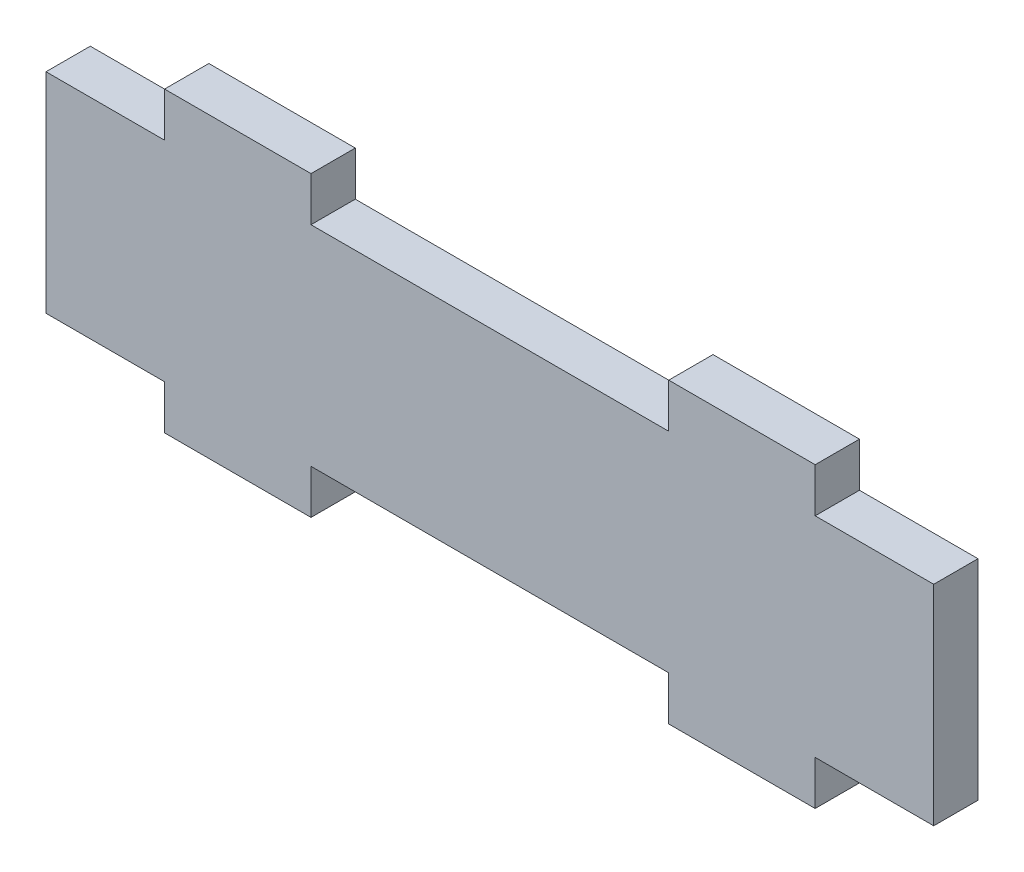
ISO-10303-21;
HEADER;
FILE_DESCRIPTION(('STEP AP214'),'2;1');
FILE_NAME('part.step','',(''),(''),'','','');
FILE_SCHEMA(('AUTOMOTIVE_DESIGN { 1 0 10303 214 1 1 1 1 }'));
ENDSEC;
DATA;
#1=APPLICATION_CONTEXT('core data for automotive mechanical design processes');
#2=APPLICATION_PROTOCOL_DEFINITION('international standard','automotive_design',2000,#1);
#3=PRODUCT_CONTEXT('',#1,'mechanical');
#4=PRODUCT('Part','Part','',(#3));
#5=PRODUCT_RELATED_PRODUCT_CATEGORY('part','',(#4));
#6=PRODUCT_DEFINITION_FORMATION('','',#4);
#7=PRODUCT_DEFINITION_CONTEXT('part definition',#1,'design');
#8=PRODUCT_DEFINITION('design','',#6,#7);
#9=PRODUCT_DEFINITION_SHAPE('','',#8);
#10=(LENGTH_UNIT() NAMED_UNIT(*) SI_UNIT(.MILLI.,.METRE.));
#11=(NAMED_UNIT(*) PLANE_ANGLE_UNIT() SI_UNIT($,.RADIAN.));
#12=(NAMED_UNIT(*) SI_UNIT($,.STERADIAN.) SOLID_ANGLE_UNIT());
#13=UNCERTAINTY_MEASURE_WITH_UNIT(LENGTH_MEASURE(1.E-05),#10,'distance_accuracy_value','');
#14=(GEOMETRIC_REPRESENTATION_CONTEXT(3) GLOBAL_UNCERTAINTY_ASSIGNED_CONTEXT((#13)) GLOBAL_UNIT_ASSIGNED_CONTEXT((#10,
#11,#12)) REPRESENTATION_CONTEXT('',''));
#15=CARTESIAN_POINT('',(0.,0.,0.));
#16=DIRECTION('',(0.,0.,1.));
#17=DIRECTION('',(1.,0.,0.));
#18=AXIS2_PLACEMENT_3D('',#15,#16,#17);
#19=CARTESIAN_POINT('',(0.,0.,0.));
#20=DIRECTION('',(0.,0.,1.));
#21=DIRECTION('',(1.,0.,0.));
#22=AXIS2_PLACEMENT_3D('',#19,#20,#21);
#23=PLANE('',#22);
#24=DIRECTION('',(0.,1.,0.));
#25=VECTOR('',#24,1.);
#26=CARTESIAN_POINT('',(23.325,0.,0.));
#27=LINE('',#26,#25);
#28=CARTESIAN_POINT('',(23.325,7.5,0.));
#29=VERTEX_POINT('',#28);
#30=CARTESIAN_POINT('',(23.325,10.675,0.));
#31=VERTEX_POINT('',#30);
#32=EDGE_CURVE('E343',#29,#31,#27,.T.);
#33=ORIENTED_EDGE('',*,*,#32,.F.);
#34=DIRECTION('',(1.,0.,0.));
#35=VECTOR('',#34,1.);
#36=CARTESIAN_POINT('',(0.,7.5,0.));
#37=LINE('',#36,#35);
#38=CARTESIAN_POINT('',(31.825,7.5,0.));
#39=VERTEX_POINT('',#38);
#40=EDGE_CURVE('E400',#29,#39,#37,.T.);
#41=ORIENTED_EDGE('',*,*,#40,.T.);
#42=DIRECTION('',(0.,1.,0.));
#43=VECTOR('',#42,1.);
#44=CARTESIAN_POINT('',(31.825,0.,0.));
#45=LINE('',#44,#43);
#46=CARTESIAN_POINT('',(31.825,-7.5,0.));
#47=VERTEX_POINT('',#46);
#48=EDGE_CURVE('E397',#47,#39,#45,.T.);
#49=ORIENTED_EDGE('',*,*,#48,.F.);
#50=DIRECTION('',(1.,0.,0.));
#51=VECTOR('',#50,1.);
#52=CARTESIAN_POINT('',(0.,-7.5,0.));
#53=LINE('',#52,#51);
#54=CARTESIAN_POINT('',(23.325,-7.5,0.));
#55=VERTEX_POINT('',#54);
#56=EDGE_CURVE('E379',#55,#47,#53,.T.);
#57=ORIENTED_EDGE('',*,*,#56,.F.);
#58=DIRECTION('',(0.,-1.,0.));
#59=VECTOR('',#58,1.);
#60=CARTESIAN_POINT('',(23.325,0.,0.));
#61=LINE('',#60,#59);
#62=CARTESIAN_POINT('',(23.325,-10.675,0.));
#63=VERTEX_POINT('',#62);
#64=EDGE_CURVE('E394',#55,#63,#61,.T.);
#65=ORIENTED_EDGE('',*,*,#64,.T.);
#66=DIRECTION('',(-1.,0.,0.));
#67=VECTOR('',#66,1.);
#68=CARTESIAN_POINT('',(0.,-10.675,0.));
#69=LINE('',#68,#67);
#70=CARTESIAN_POINT('',(12.825,-10.675,0.));
#71=VERTEX_POINT('',#70);
#72=EDGE_CURVE('E391',#63,#71,#69,.T.);
#73=ORIENTED_EDGE('',*,*,#72,.T.);
#74=DIRECTION('',(0.,-1.,0.));
#75=VECTOR('',#74,1.);
#76=CARTESIAN_POINT('',(12.825,0.,0.));
#77=LINE('',#76,#75);
#78=CARTESIAN_POINT('',(12.825,-7.5,0.));
#79=VERTEX_POINT('',#78);
#80=EDGE_CURVE('E388',#79,#71,#77,.T.);
#81=ORIENTED_EDGE('',*,*,#80,.F.);
#82=CARTESIAN_POINT('',(-12.825,-7.5,0.));
#83=VERTEX_POINT('',#82);
#84=EDGE_CURVE('E380',#83,#79,#53,.T.);
#85=ORIENTED_EDGE('',*,*,#84,.F.);
#86=DIRECTION('',(0.,-1.,0.));
#87=VECTOR('',#86,1.);
#88=CARTESIAN_POINT('',(-12.825,0.,0.));
#89=LINE('',#88,#87);
#90=CARTESIAN_POINT('',(-12.825,-10.675,0.));
#91=VERTEX_POINT('',#90);
#92=EDGE_CURVE('E385',#83,#91,#89,.T.);
#93=ORIENTED_EDGE('',*,*,#92,.T.);
#94=DIRECTION('',(1.,0.,0.));
#95=VECTOR('',#94,1.);
#96=CARTESIAN_POINT('',(0.,-10.675,0.));
#97=LINE('',#96,#95);
#98=CARTESIAN_POINT('',(-23.325,-10.675,0.));
#99=VERTEX_POINT('',#98);
#100=EDGE_CURVE('E382',#99,#91,#97,.T.);
#101=ORIENTED_EDGE('',*,*,#100,.F.);
#102=DIRECTION('',(0.,-1.,0.));
#103=VECTOR('',#102,1.);
#104=CARTESIAN_POINT('',(-23.325,0.,0.));
#105=LINE('',#104,#103);
#106=CARTESIAN_POINT('',(-23.325,-7.5,0.));
#107=VERTEX_POINT('',#106);
#108=EDGE_CURVE('E378',#107,#99,#105,.T.);
#109=ORIENTED_EDGE('',*,*,#108,.F.);
#110=CARTESIAN_POINT('',(-31.825,-7.5,0.));
#111=VERTEX_POINT('',#110);
#112=EDGE_CURVE('E332',#111,#107,#53,.T.);
#113=ORIENTED_EDGE('',*,*,#112,.F.);
#114=DIRECTION('',(0.,1.,0.));
#115=VECTOR('',#114,1.);
#116=CARTESIAN_POINT('',(-31.825,0.,0.));
#117=LINE('',#116,#115);
#118=CARTESIAN_POINT('',(-31.825,7.5,0.));
#119=VERTEX_POINT('',#118);
#120=EDGE_CURVE('E405',#111,#119,#117,.T.);
#121=ORIENTED_EDGE('',*,*,#120,.T.);
#122=CARTESIAN_POINT('',(-23.325,7.5,0.));
#123=VERTEX_POINT('',#122);
#124=EDGE_CURVE('E404',#119,#123,#37,.T.);
#125=ORIENTED_EDGE('',*,*,#124,.T.);
#126=DIRECTION('',(0.,1.,0.));
#127=VECTOR('',#126,1.);
#128=CARTESIAN_POINT('',(-23.325,4.325,0.));
#129=LINE('',#128,#127);
#130=CARTESIAN_POINT('',(-23.325,10.675,0.));
#131=VERTEX_POINT('',#130);
#132=EDGE_CURVE('E308',#123,#131,#129,.T.);
#133=ORIENTED_EDGE('',*,*,#132,.T.);
#134=DIRECTION('',(1.,0.,0.));
#135=VECTOR('',#134,1.);
#136=CARTESIAN_POINT('',(-23.325,10.675,0.));
#137=LINE('',#136,#135);
#138=CARTESIAN_POINT('',(-12.825,10.675,0.));
#139=VERTEX_POINT('',#138);
#140=EDGE_CURVE('E324',#131,#139,#137,.T.);
#141=ORIENTED_EDGE('',*,*,#140,.T.);
#142=DIRECTION('',(0.,1.,0.));
#143=VECTOR('',#142,1.);
#144=CARTESIAN_POINT('',(-12.825,4.325,0.));
#145=LINE('',#144,#143);
#146=CARTESIAN_POINT('',(-12.825,7.5,0.));
#147=VERTEX_POINT('',#146);
#148=EDGE_CURVE('E314',#147,#139,#145,.T.);
#149=ORIENTED_EDGE('',*,*,#148,.F.);
#150=CARTESIAN_POINT('',(12.825,7.5,0.));
#151=VERTEX_POINT('',#150);
#152=EDGE_CURVE('E403',#147,#151,#37,.T.);
#153=ORIENTED_EDGE('',*,*,#152,.T.);
#154=DIRECTION('',(0.,1.,0.));
#155=VECTOR('',#154,1.);
#156=CARTESIAN_POINT('',(12.825,0.,0.));
#157=LINE('',#156,#155);
#158=CARTESIAN_POINT('',(12.825,10.675,0.));
#159=VERTEX_POINT('',#158);
#160=EDGE_CURVE('E469',#151,#159,#157,.T.);
#161=ORIENTED_EDGE('',*,*,#160,.T.);
#162=DIRECTION('',(-1.,0.,0.));
#163=VECTOR('',#162,1.);
#164=CARTESIAN_POINT('',(0.,10.675,0.));
#165=LINE('',#164,#163);
#166=EDGE_CURVE('E473',#31,#159,#165,.T.);
#167=ORIENTED_EDGE('',*,*,#166,.F.);
#168=EDGE_LOOP('',(#33,#41,#49,#57,#65,#73,#81,#85,#93,#101,#109,#113,#121,#125,#133,#141,#149,
#153,#161,#167));
#169=FACE_BOUND('',#168,.T.);
#170=ADVANCED_FACE('F176',(#169),#23,.F.);
#171=CARTESIAN_POINT('',(23.325,0.,3.175));
#172=DIRECTION('',(-1.,0.,0.));
#173=DIRECTION('',(0.,-1.,0.));
#174=AXIS2_PLACEMENT_3D('',#171,#172,#173);
#175=PLANE('',#174);
#176=ORIENTED_EDGE('',*,*,#32,.T.);
#177=DIRECTION('',(0.,0.,-1.));
#178=VECTOR('',#177,1.);
#179=CARTESIAN_POINT('',(23.325,10.675,3.175));
#180=LINE('',#179,#178);
#181=CARTESIAN_POINT('',(23.325,10.675,3.175));
#182=VERTEX_POINT('',#181);
#183=EDGE_CURVE('E186',#182,#31,#180,.T.);
#184=ORIENTED_EDGE('',*,*,#183,.F.);
#185=DIRECTION('',(0.,1.,0.));
#186=VECTOR('',#185,1.);
#187=CARTESIAN_POINT('',(23.325,0.,3.175));
#188=LINE('',#187,#186);
#189=CARTESIAN_POINT('',(23.325,7.5,3.175));
#190=VERTEX_POINT('',#189);
#191=EDGE_CURVE('E461',#190,#182,#188,.T.);
#192=ORIENTED_EDGE('',*,*,#191,.F.);
#193=DIRECTION('',(0.,0.,-1.));
#194=VECTOR('',#193,1.);
#195=CARTESIAN_POINT('',(23.325,7.5,3.175));
#196=LINE('',#195,#194);
#197=EDGE_CURVE('E12',#190,#29,#196,.T.);
#198=ORIENTED_EDGE('',*,*,#197,.T.);
#199=EDGE_LOOP('',(#176,#184,#192,#198));
#200=FACE_BOUND('',#199,.T.);
#201=ADVANCED_FACE('F465',(#200),#175,.F.);
#202=CARTESIAN_POINT('',(0.,10.675,3.175));
#203=DIRECTION('',(0.,-1.,0.));
#204=DIRECTION('',(1.,0.,0.));
#205=AXIS2_PLACEMENT_3D('',#202,#203,#204);
#206=PLANE('',#205);
#207=ORIENTED_EDGE('',*,*,#166,.T.);
#208=DIRECTION('',(0.,0.,-1.));
#209=VECTOR('',#208,1.);
#210=CARTESIAN_POINT('',(12.825,10.675,3.175));
#211=LINE('',#210,#209);
#212=CARTESIAN_POINT('',(12.825,10.675,3.175));
#213=VERTEX_POINT('',#212);
#214=EDGE_CURVE('E481',#213,#159,#211,.T.);
#215=ORIENTED_EDGE('',*,*,#214,.F.);
#216=DIRECTION('',(-1.,0.,0.));
#217=VECTOR('',#216,1.);
#218=CARTESIAN_POINT('',(0.,10.675,3.175));
#219=LINE('',#218,#217);
#220=EDGE_CURVE('E468',#182,#213,#219,.T.);
#221=ORIENTED_EDGE('',*,*,#220,.F.);
#222=ORIENTED_EDGE('',*,*,#183,.T.);
#223=EDGE_LOOP('',(#207,#215,#221,#222));
#224=FACE_BOUND('',#223,.T.);
#225=ADVANCED_FACE('F522',(#224),#206,.F.);
#226=CARTESIAN_POINT('',(12.825,0.,3.175));
#227=DIRECTION('',(-1.,0.,0.));
#228=DIRECTION('',(0.,-1.,0.));
#229=AXIS2_PLACEMENT_3D('',#226,#227,#228);
#230=PLANE('',#229);
#231=ORIENTED_EDGE('',*,*,#160,.F.);
#232=DIRECTION('',(0.,0.,-1.));
#233=VECTOR('',#232,1.);
#234=CARTESIAN_POINT('',(12.825,7.5,3.175));
#235=LINE('',#234,#233);
#236=CARTESIAN_POINT('',(12.825,7.5,3.175));
#237=VERTEX_POINT('',#236);
#238=EDGE_CURVE('E195',#237,#151,#235,.T.);
#239=ORIENTED_EDGE('',*,*,#238,.F.);
#240=DIRECTION('',(0.,1.,0.));
#241=VECTOR('',#240,1.);
#242=CARTESIAN_POINT('',(12.825,0.,3.175));
#243=LINE('',#242,#241);
#244=EDGE_CURVE('E363',#237,#213,#243,.T.);
#245=ORIENTED_EDGE('',*,*,#244,.T.);
#246=ORIENTED_EDGE('',*,*,#214,.T.);
#247=EDGE_LOOP('',(#231,#239,#245,#246));
#248=FACE_BOUND('',#247,.T.);
#249=ADVANCED_FACE('F528',(#248),#230,.T.);
#250=CARTESIAN_POINT('',(0.,0.,3.175));
#251=DIRECTION('',(0.,0.,1.));
#252=DIRECTION('',(1.,0.,0.));
#253=AXIS2_PLACEMENT_3D('',#250,#251,#252);
#254=PLANE('',#253);
#255=DIRECTION('',(1.,0.,0.));
#256=VECTOR('',#255,1.);
#257=CARTESIAN_POINT('',(0.,7.5,3.175));
#258=LINE('',#257,#256);
#259=CARTESIAN_POINT('',(31.825,7.5,3.175));
#260=VERTEX_POINT('',#259);
#261=EDGE_CURVE('E365',#190,#260,#258,.T.);
#262=ORIENTED_EDGE('',*,*,#261,.F.);
#263=ORIENTED_EDGE('',*,*,#191,.T.);
#264=ORIENTED_EDGE('',*,*,#220,.T.);
#265=ORIENTED_EDGE('',*,*,#244,.F.);
#266=CARTESIAN_POINT('',(-12.825,7.5,3.175));
#267=VERTEX_POINT('',#266);
#268=EDGE_CURVE('E362',#267,#237,#258,.T.);
#269=ORIENTED_EDGE('',*,*,#268,.F.);
#270=DIRECTION('',(0.,1.,0.));
#271=VECTOR('',#270,1.);
#272=CARTESIAN_POINT('',(-12.825,4.325,3.175));
#273=LINE('',#272,#271);
#274=CARTESIAN_POINT('',(-12.825,10.675,3.175));
#275=VERTEX_POINT('',#274);
#276=EDGE_CURVE('E340',#267,#275,#273,.T.);
#277=ORIENTED_EDGE('',*,*,#276,.T.);
#278=DIRECTION('',(1.,0.,0.));
#279=VECTOR('',#278,1.);
#280=CARTESIAN_POINT('',(-23.325,10.675,3.175));
#281=LINE('',#280,#279);
#282=CARTESIAN_POINT('',(-23.325,10.675,3.175));
#283=VERTEX_POINT('',#282);
#284=EDGE_CURVE('E331',#283,#275,#281,.T.);
#285=ORIENTED_EDGE('',*,*,#284,.F.);
#286=DIRECTION('',(0.,1.,0.));
#287=VECTOR('',#286,1.);
#288=CARTESIAN_POINT('',(-23.325,4.325,3.175));
#289=LINE('',#288,#287);
#290=CARTESIAN_POINT('',(-23.325,7.5,3.175));
#291=VERTEX_POINT('',#290);
#292=EDGE_CURVE('E323',#291,#283,#289,.T.);
#293=ORIENTED_EDGE('',*,*,#292,.F.);
#294=CARTESIAN_POINT('',(-31.825,7.5,3.175));
#295=VERTEX_POINT('',#294);
#296=EDGE_CURVE('E364',#295,#291,#258,.T.);
#297=ORIENTED_EDGE('',*,*,#296,.F.);
#298=DIRECTION('',(0.,1.,0.));
#299=VECTOR('',#298,1.);
#300=CARTESIAN_POINT('',(-31.825,0.,3.175));
#301=LINE('',#300,#299);
#302=CARTESIAN_POINT('',(-31.825,-7.5,3.175));
#303=VERTEX_POINT('',#302);
#304=EDGE_CURVE('E368',#303,#295,#301,.T.);
#305=ORIENTED_EDGE('',*,*,#304,.F.);
#306=DIRECTION('',(1.,0.,0.));
#307=VECTOR('',#306,1.);
#308=CARTESIAN_POINT('',(0.,-7.5,3.175));
#309=LINE('',#308,#307);
#310=CARTESIAN_POINT('',(-23.325,-7.5,3.175));
#311=VERTEX_POINT('',#310);
#312=EDGE_CURVE('E408',#303,#311,#309,.T.);
#313=ORIENTED_EDGE('',*,*,#312,.T.);
#314=DIRECTION('',(0.,-1.,0.));
#315=VECTOR('',#314,1.);
#316=CARTESIAN_POINT('',(-23.325,0.,3.175));
#317=LINE('',#316,#315);
#318=CARTESIAN_POINT('',(-23.325,-10.675,3.175));
#319=VERTEX_POINT('',#318);
#320=EDGE_CURVE('E486',#311,#319,#317,.T.);
#321=ORIENTED_EDGE('',*,*,#320,.T.);
#322=DIRECTION('',(1.,0.,0.));
#323=VECTOR('',#322,1.);
#324=CARTESIAN_POINT('',(0.,-10.675,3.175));
#325=LINE('',#324,#323);
#326=CARTESIAN_POINT('',(-12.825,-10.675,3.175));
#327=VERTEX_POINT('',#326);
#328=EDGE_CURVE('E490',#319,#327,#325,.T.);
#329=ORIENTED_EDGE('',*,*,#328,.T.);
#330=DIRECTION('',(0.,-1.,0.));
#331=VECTOR('',#330,1.);
#332=CARTESIAN_POINT('',(-12.825,0.,3.175));
#333=LINE('',#332,#331);
#334=CARTESIAN_POINT('',(-12.825,-7.5,3.175));
#335=VERTEX_POINT('',#334);
#336=EDGE_CURVE('E433',#335,#327,#333,.T.);
#337=ORIENTED_EDGE('',*,*,#336,.F.);
#338=CARTESIAN_POINT('',(12.825,-7.5,3.175));
#339=VERTEX_POINT('',#338);
#340=EDGE_CURVE('E488',#335,#339,#309,.T.);
#341=ORIENTED_EDGE('',*,*,#340,.T.);
#342=DIRECTION('',(0.,-1.,0.));
#343=VECTOR('',#342,1.);
#344=CARTESIAN_POINT('',(12.825,0.,3.175));
#345=LINE('',#344,#343);
#346=CARTESIAN_POINT('',(12.825,-10.675,3.175));
#347=VERTEX_POINT('',#346);
#348=EDGE_CURVE('E493',#339,#347,#345,.T.);
#349=ORIENTED_EDGE('',*,*,#348,.T.);
#350=DIRECTION('',(-1.,0.,0.));
#351=VECTOR('',#350,1.);
#352=CARTESIAN_POINT('',(0.,-10.675,3.175));
#353=LINE('',#352,#351);
#354=CARTESIAN_POINT('',(23.325,-10.675,3.175));
#355=VERTEX_POINT('',#354);
#356=EDGE_CURVE('E495',#355,#347,#353,.T.);
#357=ORIENTED_EDGE('',*,*,#356,.F.);
#358=DIRECTION('',(0.,-1.,0.));
#359=VECTOR('',#358,1.);
#360=CARTESIAN_POINT('',(23.325,0.,3.175));
#361=LINE('',#360,#359);
#362=CARTESIAN_POINT('',(23.325,-7.5,3.175));
#363=VERTEX_POINT('',#362);
#364=EDGE_CURVE('E497',#363,#355,#361,.T.);
#365=ORIENTED_EDGE('',*,*,#364,.F.);
#366=CARTESIAN_POINT('',(31.825,-7.5,3.175));
#367=VERTEX_POINT('',#366);
#368=EDGE_CURVE('E487',#363,#367,#309,.T.);
#369=ORIENTED_EDGE('',*,*,#368,.T.);
#370=DIRECTION('',(0.,1.,0.));
#371=VECTOR('',#370,1.);
#372=CARTESIAN_POINT('',(31.825,0.,3.175));
#373=LINE('',#372,#371);
#374=EDGE_CURVE('E370',#367,#260,#373,.T.);
#375=ORIENTED_EDGE('',*,*,#374,.T.);
#376=EDGE_LOOP('',(#262,#263,#264,#265,#269,#277,#285,#293,#297,#305,#313,#321,#329,#337,#341,
#349,#357,#365,#369,#375));
#377=FACE_BOUND('',#376,.T.);
#378=ADVANCED_FACE('F359',(#377),#254,.T.);
#379=CARTESIAN_POINT('',(-23.325,4.325,3.175));
#380=DIRECTION('',(-1.,0.,0.));
#381=DIRECTION('',(0.,-1.,0.));
#382=AXIS2_PLACEMENT_3D('',#379,#380,#381);
#383=PLANE('',#382);
#384=ORIENTED_EDGE('',*,*,#132,.F.);
#385=DIRECTION('',(0.,0.,1.));
#386=VECTOR('',#385,1.);
#387=CARTESIAN_POINT('',(-23.325,7.5,3.175));
#388=LINE('',#387,#386);
#389=EDGE_CURVE('E180',#123,#291,#388,.T.);
#390=ORIENTED_EDGE('',*,*,#389,.T.);
#391=ORIENTED_EDGE('',*,*,#292,.T.);
#392=DIRECTION('',(0.,0.,-1.));
#393=VECTOR('',#392,1.);
#394=CARTESIAN_POINT('',(-23.325,10.675,3.175));
#395=LINE('',#394,#393);
#396=EDGE_CURVE('E333',#283,#131,#395,.T.);
#397=ORIENTED_EDGE('',*,*,#396,.T.);
#398=EDGE_LOOP('',(#384,#390,#391,#397));
#399=FACE_BOUND('',#398,.T.);
#400=ADVANCED_FACE('F178',(#399),#383,.T.);
#401=CARTESIAN_POINT('',(-23.325,10.675,3.175));
#402=DIRECTION('',(0.,1.,0.));
#403=DIRECTION('',(0.,0.,1.));
#404=AXIS2_PLACEMENT_3D('',#401,#402,#403);
#405=PLANE('',#404);
#406=ORIENTED_EDGE('',*,*,#140,.F.);
#407=ORIENTED_EDGE('',*,*,#396,.F.);
#408=ORIENTED_EDGE('',*,*,#284,.T.);
#409=DIRECTION('',(0.,0.,-1.));
#410=VECTOR('',#409,1.);
#411=CARTESIAN_POINT('',(-12.825,10.675,3.175));
#412=LINE('',#411,#410);
#413=EDGE_CURVE('E318',#275,#139,#412,.T.);
#414=ORIENTED_EDGE('',*,*,#413,.T.);
#415=EDGE_LOOP('',(#406,#407,#408,#414));
#416=FACE_BOUND('',#415,.T.);
#417=ADVANCED_FACE('F328',(#416),#405,.T.);
#418=CARTESIAN_POINT('',(0.,7.5,3.175));
#419=DIRECTION('',(0.,1.,0.));
#420=DIRECTION('',(0.,0.,1.));
#421=AXIS2_PLACEMENT_3D('',#418,#419,#420);
#422=PLANE('',#421);
#423=ORIENTED_EDGE('',*,*,#389,.F.);
#424=ORIENTED_EDGE('',*,*,#124,.F.);
#425=DIRECTION('',(0.,0.,-1.));
#426=VECTOR('',#425,1.);
#427=CARTESIAN_POINT('',(-31.825,7.5,3.175));
#428=LINE('',#427,#426);
#429=EDGE_CURVE('E410',#295,#119,#428,.T.);
#430=ORIENTED_EDGE('',*,*,#429,.F.);
#431=ORIENTED_EDGE('',*,*,#296,.T.);
#432=EDGE_LOOP('',(#423,#424,#430,#431));
#433=FACE_BOUND('',#432,.T.);
#434=ADVANCED_FACE('F537',(#433),#422,.T.);
#435=CARTESIAN_POINT('',(-31.825,0.,3.175));
#436=DIRECTION('',(-1.,0.,0.));
#437=DIRECTION('',(0.,0.,1.));
#438=AXIS2_PLACEMENT_3D('',#435,#436,#437);
#439=PLANE('',#438);
#440=ORIENTED_EDGE('',*,*,#120,.F.);
#441=DIRECTION('',(0.,0.,-1.));
#442=VECTOR('',#441,1.);
#443=CARTESIAN_POINT('',(-31.825,-7.5,3.175));
#444=LINE('',#443,#442);
#445=EDGE_CURVE('E376',#303,#111,#444,.T.);
#446=ORIENTED_EDGE('',*,*,#445,.F.);
#447=ORIENTED_EDGE('',*,*,#304,.T.);
#448=ORIENTED_EDGE('',*,*,#429,.T.);
#449=EDGE_LOOP('',(#440,#446,#447,#448));
#450=FACE_BOUND('',#449,.T.);
#451=ADVANCED_FACE('F534',(#450),#439,.T.);
#452=CARTESIAN_POINT('',(0.,-7.5,3.175));
#453=DIRECTION('',(0.,1.,0.));
#454=DIRECTION('',(0.,0.,1.));
#455=AXIS2_PLACEMENT_3D('',#452,#453,#454);
#456=PLANE('',#455);
#457=ORIENTED_EDGE('',*,*,#112,.T.);
#458=DIRECTION('',(0.,0.,-1.));
#459=VECTOR('',#458,1.);
#460=CARTESIAN_POINT('',(-23.325,-7.5,3.175));
#461=LINE('',#460,#459);
#462=EDGE_CURVE('E341',#311,#107,#461,.T.);
#463=ORIENTED_EDGE('',*,*,#462,.F.);
#464=ORIENTED_EDGE('',*,*,#312,.F.);
#465=ORIENTED_EDGE('',*,*,#445,.T.);
#466=EDGE_LOOP('',(#457,#463,#464,#465));
#467=FACE_BOUND('',#466,.T.);
#468=ADVANCED_FACE('F519',(#467),#456,.F.);
#469=CARTESIAN_POINT('',(-23.325,0.,3.175));
#470=DIRECTION('',(1.,0.,0.));
#471=DIRECTION('',(0.,1.,0.));
#472=AXIS2_PLACEMENT_3D('',#469,#470,#471);
#473=PLANE('',#472);
#474=ORIENTED_EDGE('',*,*,#108,.T.);
#475=DIRECTION('',(0.,0.,-1.));
#476=VECTOR('',#475,1.);
#477=CARTESIAN_POINT('',(-23.325,-10.675,3.175));
#478=LINE('',#477,#476);
#479=EDGE_CURVE('E345',#319,#99,#478,.T.);
#480=ORIENTED_EDGE('',*,*,#479,.F.);
#481=ORIENTED_EDGE('',*,*,#320,.F.);
#482=ORIENTED_EDGE('',*,*,#462,.T.);
#483=EDGE_LOOP('',(#474,#480,#481,#482));
#484=FACE_BOUND('',#483,.T.);
#485=ADVANCED_FACE('F552',(#484),#473,.F.);
#486=CARTESIAN_POINT('',(0.,-10.675,3.175));
#487=DIRECTION('',(0.,1.,0.));
#488=DIRECTION('',(0.,0.,1.));
#489=AXIS2_PLACEMENT_3D('',#486,#487,#488);
#490=PLANE('',#489);
#491=ORIENTED_EDGE('',*,*,#100,.T.);
#492=DIRECTION('',(0.,0.,-1.));
#493=VECTOR('',#492,1.);
#494=CARTESIAN_POINT('',(-12.825,-10.675,3.175));
#495=LINE('',#494,#493);
#496=EDGE_CURVE('E351',#327,#91,#495,.T.);
#497=ORIENTED_EDGE('',*,*,#496,.F.);
#498=ORIENTED_EDGE('',*,*,#328,.F.);
#499=ORIENTED_EDGE('',*,*,#479,.T.);
#500=EDGE_LOOP('',(#491,#497,#498,#499));
#501=FACE_BOUND('',#500,.T.);
#502=ADVANCED_FACE('F437',(#501),#490,.F.);
#503=CARTESIAN_POINT('',(-12.825,0.,3.175));
#504=DIRECTION('',(1.,0.,0.));
#505=DIRECTION('',(0.,0.,-1.));
#506=AXIS2_PLACEMENT_3D('',#503,#504,#505);
#507=PLANE('',#506);
#508=ORIENTED_EDGE('',*,*,#92,.F.);
#509=DIRECTION('',(0.,0.,-1.));
#510=VECTOR('',#509,1.);
#511=CARTESIAN_POINT('',(-12.825,-7.5,3.175));
#512=LINE('',#511,#510);
#513=EDGE_CURVE('E426',#335,#83,#512,.T.);
#514=ORIENTED_EDGE('',*,*,#513,.F.);
#515=ORIENTED_EDGE('',*,*,#336,.T.);
#516=ORIENTED_EDGE('',*,*,#496,.T.);
#517=EDGE_LOOP('',(#508,#514,#515,#516));
#518=FACE_BOUND('',#517,.T.);
#519=ADVANCED_FACE('F431',(#518),#507,.T.);
#520=ORIENTED_EDGE('',*,*,#84,.T.);
#521=DIRECTION('',(0.,0.,-1.));
#522=VECTOR('',#521,1.);
#523=CARTESIAN_POINT('',(12.825,-7.5,3.175));
#524=LINE('',#523,#522);
#525=EDGE_CURVE('E423',#339,#79,#524,.T.);
#526=ORIENTED_EDGE('',*,*,#525,.F.);
#527=ORIENTED_EDGE('',*,*,#340,.F.);
#528=ORIENTED_EDGE('',*,*,#513,.T.);
#529=EDGE_LOOP('',(#520,#526,#527,#528));
#530=FACE_BOUND('',#529,.T.);
#531=ADVANCED_FACE('F505',(#530),#456,.F.);
#532=CARTESIAN_POINT('',(12.825,0.,3.175));
#533=DIRECTION('',(1.,0.,0.));
#534=DIRECTION('',(0.,1.,0.));
#535=AXIS2_PLACEMENT_3D('',#532,#533,#534);
#536=PLANE('',#535);
#537=ORIENTED_EDGE('',*,*,#80,.T.);
#538=DIRECTION('',(0.,0.,-1.));
#539=VECTOR('',#538,1.);
#540=CARTESIAN_POINT('',(12.825,-10.675,3.175));
#541=LINE('',#540,#539);
#542=EDGE_CURVE('E421',#347,#71,#541,.T.);
#543=ORIENTED_EDGE('',*,*,#542,.F.);
#544=ORIENTED_EDGE('',*,*,#348,.F.);
#545=ORIENTED_EDGE('',*,*,#525,.T.);
#546=EDGE_LOOP('',(#537,#543,#544,#545));
#547=FACE_BOUND('',#546,.T.);
#548=ADVANCED_FACE('F507',(#547),#536,.F.);
#549=CARTESIAN_POINT('',(0.,-10.675,3.175));
#550=DIRECTION('',(0.,-1.,0.));
#551=DIRECTION('',(1.,0.,0.));
#552=AXIS2_PLACEMENT_3D('',#549,#550,#551);
#553=PLANE('',#552);
#554=ORIENTED_EDGE('',*,*,#72,.F.);
#555=DIRECTION('',(0.,0.,-1.));
#556=VECTOR('',#555,1.);
#557=CARTESIAN_POINT('',(23.325,-10.675,3.175));
#558=LINE('',#557,#556);
#559=EDGE_CURVE('E419',#355,#63,#558,.T.);
#560=ORIENTED_EDGE('',*,*,#559,.F.);
#561=ORIENTED_EDGE('',*,*,#356,.T.);
#562=ORIENTED_EDGE('',*,*,#542,.T.);
#563=EDGE_LOOP('',(#554,#560,#561,#562));
#564=FACE_BOUND('',#563,.T.);
#565=ADVANCED_FACE('F510',(#564),#553,.T.);
#566=CARTESIAN_POINT('',(23.325,0.,3.175));
#567=DIRECTION('',(1.,0.,0.));
#568=DIRECTION('',(0.,1.,0.));
#569=AXIS2_PLACEMENT_3D('',#566,#567,#568);
#570=PLANE('',#569);
#571=ORIENTED_EDGE('',*,*,#64,.F.);
#572=DIRECTION('',(0.,0.,-1.));
#573=VECTOR('',#572,1.);
#574=CARTESIAN_POINT('',(23.325,-7.5,3.175));
#575=LINE('',#574,#573);
#576=EDGE_CURVE('E417',#363,#55,#575,.T.);
#577=ORIENTED_EDGE('',*,*,#576,.F.);
#578=ORIENTED_EDGE('',*,*,#364,.T.);
#579=ORIENTED_EDGE('',*,*,#559,.T.);
#580=EDGE_LOOP('',(#571,#577,#578,#579));
#581=FACE_BOUND('',#580,.T.);
#582=ADVANCED_FACE('F511',(#581),#570,.T.);
#583=ORIENTED_EDGE('',*,*,#56,.T.);
#584=DIRECTION('',(0.,0.,-1.));
#585=VECTOR('',#584,1.);
#586=CARTESIAN_POINT('',(31.825,-7.5,3.175));
#587=LINE('',#586,#585);
#588=EDGE_CURVE('E414',#367,#47,#587,.T.);
#589=ORIENTED_EDGE('',*,*,#588,.F.);
#590=ORIENTED_EDGE('',*,*,#368,.F.);
#591=ORIENTED_EDGE('',*,*,#576,.T.);
#592=EDGE_LOOP('',(#583,#589,#590,#591));
#593=FACE_BOUND('',#592,.T.);
#594=ADVANCED_FACE('F446',(#593),#456,.F.);
#595=CARTESIAN_POINT('',(31.825,0.,3.175));
#596=DIRECTION('',(-1.,0.,0.));
#597=DIRECTION('',(0.,0.,1.));
#598=AXIS2_PLACEMENT_3D('',#595,#596,#597);
#599=PLANE('',#598);
#600=ORIENTED_EDGE('',*,*,#48,.T.);
#601=DIRECTION('',(0.,0.,-1.));
#602=VECTOR('',#601,1.);
#603=CARTESIAN_POINT('',(31.825,7.5,3.175));
#604=LINE('',#603,#602);
#605=EDGE_CURVE('E412',#260,#39,#604,.T.);
#606=ORIENTED_EDGE('',*,*,#605,.F.);
#607=ORIENTED_EDGE('',*,*,#374,.F.);
#608=ORIENTED_EDGE('',*,*,#588,.T.);
#609=EDGE_LOOP('',(#600,#606,#607,#608));
#610=FACE_BOUND('',#609,.T.);
#611=ADVANCED_FACE('F452',(#610),#599,.F.);
#612=CARTESIAN_POINT('',(-12.825,4.325,3.175));
#613=DIRECTION('',(-1.,0.,0.));
#614=DIRECTION('',(0.,0.,1.));
#615=AXIS2_PLACEMENT_3D('',#612,#613,#614);
#616=PLANE('',#615);
#617=DIRECTION('',(0.,0.,1.));
#618=VECTOR('',#617,1.);
#619=CARTESIAN_POINT('',(-12.825,7.5,3.175));
#620=LINE('',#619,#618);
#621=EDGE_CURVE('E320',#147,#267,#620,.T.);
#622=ORIENTED_EDGE('',*,*,#621,.F.);
#623=ORIENTED_EDGE('',*,*,#148,.T.);
#624=ORIENTED_EDGE('',*,*,#413,.F.);
#625=ORIENTED_EDGE('',*,*,#276,.F.);
#626=EDGE_LOOP('',(#622,#623,#624,#625));
#627=FACE_BOUND('',#626,.T.);
#628=ADVANCED_FACE('F316',(#627),#616,.F.);
#629=ORIENTED_EDGE('',*,*,#152,.F.);
#630=ORIENTED_EDGE('',*,*,#621,.T.);
#631=ORIENTED_EDGE('',*,*,#268,.T.);
#632=ORIENTED_EDGE('',*,*,#238,.T.);
#633=EDGE_LOOP('',(#629,#630,#631,#632));
#634=FACE_BOUND('',#633,.T.);
#635=ADVANCED_FACE('F542',(#634),#422,.T.);
#636=ORIENTED_EDGE('',*,*,#40,.F.);
#637=ORIENTED_EDGE('',*,*,#197,.F.);
#638=ORIENTED_EDGE('',*,*,#261,.T.);
#639=ORIENTED_EDGE('',*,*,#605,.T.);
#640=EDGE_LOOP('',(#636,#637,#638,#639));
#641=FACE_BOUND('',#640,.T.);
#642=ADVANCED_FACE('F458',(#641),#422,.T.);
#643=CLOSED_SHELL('',(#170,#201,#225,#249,#378,#400,#417,#434,#451,#468,#485,#502,#519,#531,
#548,#565,#582,#594,#611,#628,#635,#642));
#644=MANIFOLD_SOLID_BREP('B2',#643);
#645=ADVANCED_BREP_SHAPE_REPRESENTATION('',(#18,#644),#14);
#646=SHAPE_DEFINITION_REPRESENTATION(#9,#645);
ENDSEC;
END-ISO-10303-21;
